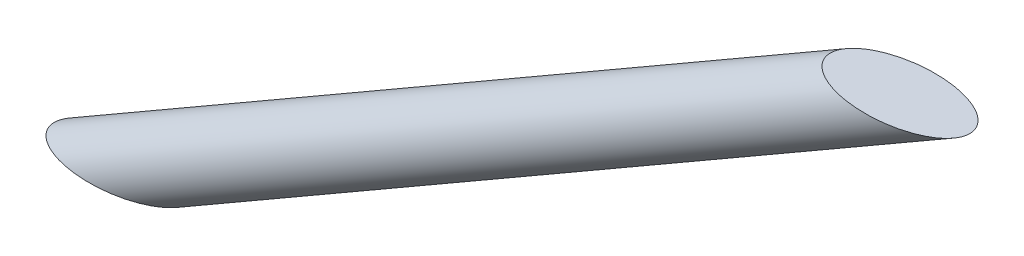
ISO-10303-21;
HEADER;
FILE_DESCRIPTION(('STEP AP214'),'2;1');
FILE_NAME('part.step','',(''),(''),'','','');
FILE_SCHEMA(('AUTOMOTIVE_DESIGN { 1 0 10303 214 1 1 1 1 }'));
ENDSEC;
DATA;
#1=APPLICATION_CONTEXT('core data for automotive mechanical design processes');
#2=APPLICATION_PROTOCOL_DEFINITION('international standard','automotive_design',2000,#1);
#3=PRODUCT_CONTEXT('',#1,'mechanical');
#4=PRODUCT('Part','Part','',(#3));
#5=PRODUCT_RELATED_PRODUCT_CATEGORY('part','',(#4));
#6=PRODUCT_DEFINITION_FORMATION('','',#4);
#7=PRODUCT_DEFINITION_CONTEXT('part definition',#1,'design');
#8=PRODUCT_DEFINITION('design','',#6,#7);
#9=PRODUCT_DEFINITION_SHAPE('','',#8);
#10=(LENGTH_UNIT() NAMED_UNIT(*) SI_UNIT(.MILLI.,.METRE.));
#11=(NAMED_UNIT(*) PLANE_ANGLE_UNIT() SI_UNIT($,.RADIAN.));
#12=(NAMED_UNIT(*) SI_UNIT($,.STERADIAN.) SOLID_ANGLE_UNIT());
#13=UNCERTAINTY_MEASURE_WITH_UNIT(LENGTH_MEASURE(1.E-05),#10,'distance_accuracy_value','');
#14=(GEOMETRIC_REPRESENTATION_CONTEXT(3) GLOBAL_UNCERTAINTY_ASSIGNED_CONTEXT((#13)) GLOBAL_UNIT_ASSIGNED_CONTEXT((#10,
#11,#12)) REPRESENTATION_CONTEXT('',''));
#15=CARTESIAN_POINT('',(0.,0.,0.));
#16=DIRECTION('',(0.,0.,1.));
#17=DIRECTION('',(1.,0.,0.));
#18=AXIS2_PLACEMENT_3D('',#15,#16,#17);
#19=CARTESIAN_POINT('',(-25.7969014236262,-22.6373070046959,-0.000111154481309506));
#20=DIRECTION('',(-0.866025403784436,-0.500000000000004,0.));
#21=DIRECTION('',(0.500000000000004,-0.866025403784436,0.));
#22=AXIS2_PLACEMENT_3D('',#19,#20,#21);
#23=CYLINDRICAL_SURFACE('',#22,7.50000000000001);
#24=CARTESIAN_POINT('',(129.749921350095,67.1676929953042,-0.000111154481303016));
#25=DIRECTION('',(1.27021716659618E-05,0.999999999919328,0.));
#26=DIRECTION('',(-0.999999999919327,1.27021716659618E-05,0.));
#27=AXIS2_PLACEMENT_3D('',#24,#25,#26);
#28=ELLIPSE('',#27,14.9996699963699,7.50000000000001);
#29=CARTESIAN_POINT('',(114.750251354935,67.1678835236875,-0.000111154481311669));
#30=VERTEX_POINT('',#29);
#31=EDGE_CURVE('E40',#30,#30,#28,.T.);
#32=ORIENTED_EDGE('',*,*,#31,.F.);
#33=EDGE_LOOP('',(#32));
#34=FACE_BOUND('',#33,.T.);
#35=CARTESIAN_POINT('',(-37.0469014236261,-29.1324975330792,-0.000111154481305017));
#36=DIRECTION('',(0.,1.,0.));
#37=DIRECTION('',(1.,0.,0.));
#38=AXIS2_PLACEMENT_3D('',#35,#36,#37);
#39=ELLIPSE('',#38,14.9999999999999,7.50000000000001);
#40=CARTESIAN_POINT('',(-22.0469014236261,-29.1324975330792,-0.000111154481311002));
#41=VERTEX_POINT('',#40);
#42=EDGE_CURVE('E10',#41,#41,#39,.T.);
#43=ORIENTED_EDGE('',*,*,#42,.T.);
#44=EDGE_LOOP('',(#43));
#45=FACE_BOUND('',#44,.T.);
#46=ADVANCED_FACE('F34',(#34,#45),#23,.T.);
#47=CARTESIAN_POINT('',(-22.0469014236262,-29.1324975330792,-17.0001111544813));
#48=DIRECTION('',(0.,1.,0.));
#49=DIRECTION('',(-1.,0.,0.));
#50=AXIS2_PLACEMENT_3D('',#47,#48,#49);
#51=PLANE('',#50);
#52=ORIENTED_EDGE('',*,*,#42,.F.);
#53=EDGE_LOOP('',(#52));
#54=FACE_BOUND('',#53,.T.);
#55=ADVANCED_FACE('F49',(#54),#51,.F.);
#56=CARTESIAN_POINT('',(114.750251354935,67.1678835236875,-11.5001111544813));
#57=DIRECTION('',(1.27021716659618E-05,0.999999999919328,0.));
#58=DIRECTION('',(-0.999999999919327,1.27021716659618E-05,0.));
#59=AXIS2_PLACEMENT_3D('',#56,#57,#58);
#60=PLANE('',#59);
#61=ORIENTED_EDGE('',*,*,#31,.T.);
#62=EDGE_LOOP('',(#61));
#63=FACE_BOUND('',#62,.T.);
#64=ADVANCED_FACE('F46',(#63),#60,.T.);
#65=CLOSED_SHELL('',(#46,#55,#64));
#66=MANIFOLD_SOLID_BREP('B2',#65);
#67=ADVANCED_BREP_SHAPE_REPRESENTATION('',(#18,#66),#14);
#68=SHAPE_DEFINITION_REPRESENTATION(#9,#67);
ENDSEC;
END-ISO-10303-21;
